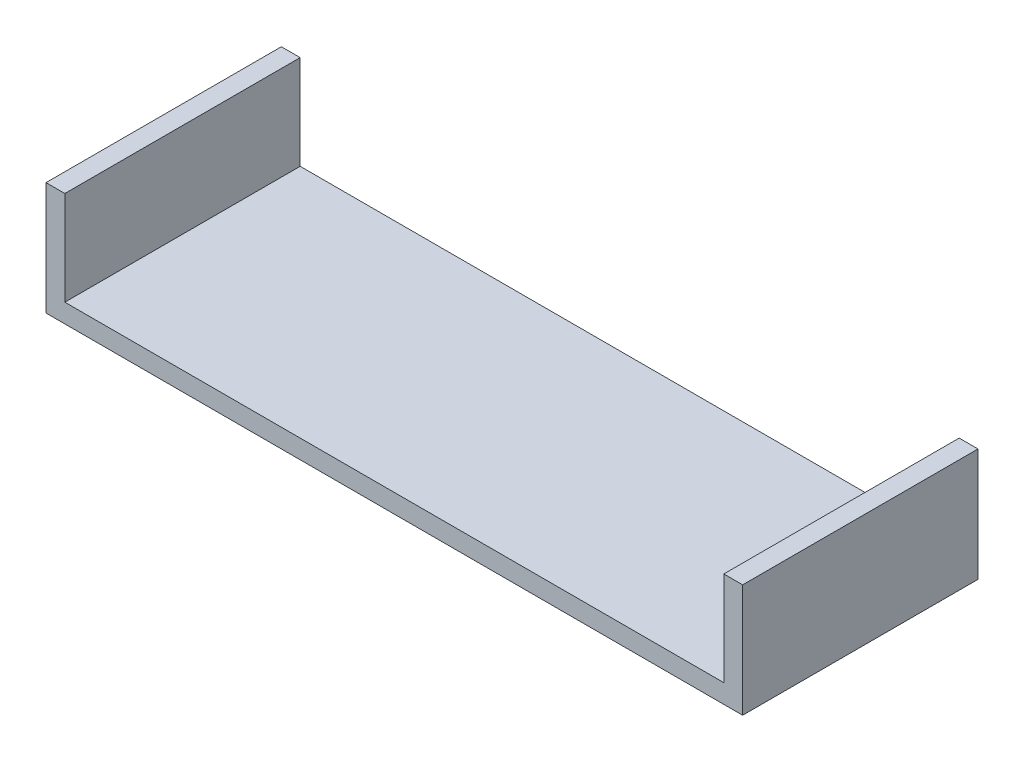
ISO-10303-21;
HEADER;
FILE_DESCRIPTION(('STEP AP214'),'2;1');
FILE_NAME('part.step','',(''),(''),'','','');
FILE_SCHEMA(('AUTOMOTIVE_DESIGN { 1 0 10303 214 1 1 1 1 }'));
ENDSEC;
DATA;
#1=APPLICATION_CONTEXT('core data for automotive mechanical design processes');
#2=APPLICATION_PROTOCOL_DEFINITION('international standard','automotive_design',2000,#1);
#3=PRODUCT_CONTEXT('',#1,'mechanical');
#4=PRODUCT('Part','Part','',(#3));
#5=PRODUCT_RELATED_PRODUCT_CATEGORY('part','',(#4));
#6=PRODUCT_DEFINITION_FORMATION('','',#4);
#7=PRODUCT_DEFINITION_CONTEXT('part definition',#1,'design');
#8=PRODUCT_DEFINITION('design','',#6,#7);
#9=PRODUCT_DEFINITION_SHAPE('','',#8);
#10=(LENGTH_UNIT() NAMED_UNIT(*) SI_UNIT(.MILLI.,.METRE.));
#11=(NAMED_UNIT(*) PLANE_ANGLE_UNIT() SI_UNIT($,.RADIAN.));
#12=(NAMED_UNIT(*) SI_UNIT($,.STERADIAN.) SOLID_ANGLE_UNIT());
#13=UNCERTAINTY_MEASURE_WITH_UNIT(LENGTH_MEASURE(1.E-05),#10,'distance_accuracy_value','');
#14=(GEOMETRIC_REPRESENTATION_CONTEXT(3) GLOBAL_UNCERTAINTY_ASSIGNED_CONTEXT((#13)) GLOBAL_UNIT_ASSIGNED_CONTEXT((#10,
#11,#12)) REPRESENTATION_CONTEXT('',''));
#15=CARTESIAN_POINT('',(0.,0.,0.));
#16=DIRECTION('',(0.,0.,1.));
#17=DIRECTION('',(1.,0.,0.));
#18=AXIS2_PLACEMENT_3D('',#15,#16,#17);
#19=CARTESIAN_POINT('',(-889.,304.8,317.5));
#20=DIRECTION('',(1.,0.,0.));
#21=DIRECTION('',(0.,0.,-1.));
#22=AXIS2_PLACEMENT_3D('',#19,#20,#21);
#23=PLANE('',#22);
#24=DIRECTION('',(0.,-1.,0.));
#25=VECTOR('',#24,1.);
#26=CARTESIAN_POINT('',(-889.,304.8,-317.5));
#27=LINE('',#26,#25);
#28=CARTESIAN_POINT('',(-889.,304.8,-317.5));
#29=VERTEX_POINT('',#28);
#30=CARTESIAN_POINT('',(-889.,50.8,-317.5));
#31=VERTEX_POINT('',#30);
#32=EDGE_CURVE('E142',#29,#31,#27,.T.);
#33=ORIENTED_EDGE('',*,*,#32,.F.);
#34=DIRECTION('',(0.,0.,-1.));
#35=VECTOR('',#34,1.);
#36=CARTESIAN_POINT('',(-889.,304.8,317.5));
#37=LINE('',#36,#35);
#38=CARTESIAN_POINT('',(-889.,304.8,317.5));
#39=VERTEX_POINT('',#38);
#40=EDGE_CURVE('E11',#39,#29,#37,.T.);
#41=ORIENTED_EDGE('',*,*,#40,.F.);
#42=DIRECTION('',(0.,-1.,0.));
#43=VECTOR('',#42,1.);
#44=CARTESIAN_POINT('',(-889.,304.8,317.5));
#45=LINE('',#44,#43);
#46=CARTESIAN_POINT('',(-889.,50.8,317.5));
#47=VERTEX_POINT('',#46);
#48=EDGE_CURVE('E168',#39,#47,#45,.T.);
#49=ORIENTED_EDGE('',*,*,#48,.T.);
#50=DIRECTION('',(0.,0.,-1.));
#51=VECTOR('',#50,1.);
#52=CARTESIAN_POINT('',(-889.,50.8,317.5));
#53=LINE('',#52,#51);
#54=EDGE_CURVE('E46',#47,#31,#53,.T.);
#55=ORIENTED_EDGE('',*,*,#54,.T.);
#56=EDGE_LOOP('',(#33,#41,#49,#55));
#57=FACE_BOUND('',#56,.T.);
#58=ADVANCED_FACE('F43',(#57),#23,.T.);
#59=CARTESIAN_POINT('',(-939.8,304.8,317.5));
#60=DIRECTION('',(0.,1.,0.));
#61=DIRECTION('',(0.,0.,1.));
#62=AXIS2_PLACEMENT_3D('',#59,#60,#61);
#63=PLANE('',#62);
#64=DIRECTION('',(1.,0.,0.));
#65=VECTOR('',#64,1.);
#66=CARTESIAN_POINT('',(-939.8,304.8,-317.5));
#67=LINE('',#66,#65);
#68=CARTESIAN_POINT('',(-939.8,304.8,-317.5));
#69=VERTEX_POINT('',#68);
#70=EDGE_CURVE('E165',#69,#29,#67,.T.);
#71=ORIENTED_EDGE('',*,*,#70,.F.);
#72=DIRECTION('',(0.,0.,-1.));
#73=VECTOR('',#72,1.);
#74=CARTESIAN_POINT('',(-939.8,304.8,317.5));
#75=LINE('',#74,#73);
#76=CARTESIAN_POINT('',(-939.8,304.8,317.5));
#77=VERTEX_POINT('',#76);
#78=EDGE_CURVE('E53',#77,#69,#75,.T.);
#79=ORIENTED_EDGE('',*,*,#78,.F.);
#80=DIRECTION('',(1.,0.,0.));
#81=VECTOR('',#80,1.);
#82=CARTESIAN_POINT('',(-939.8,304.8,317.5));
#83=LINE('',#82,#81);
#84=EDGE_CURVE('E135',#77,#39,#83,.T.);
#85=ORIENTED_EDGE('',*,*,#84,.T.);
#86=ORIENTED_EDGE('',*,*,#40,.T.);
#87=EDGE_LOOP('',(#71,#79,#85,#86));
#88=FACE_BOUND('',#87,.T.);
#89=ADVANCED_FACE('F189',(#88),#63,.T.);
#90=CARTESIAN_POINT('',(-939.8,0.,317.5));
#91=DIRECTION('',(-1.,0.,0.));
#92=DIRECTION('',(0.,0.,1.));
#93=AXIS2_PLACEMENT_3D('',#90,#91,#92);
#94=PLANE('',#93);
#95=DIRECTION('',(0.,1.,0.));
#96=VECTOR('',#95,1.);
#97=CARTESIAN_POINT('',(-939.8,0.,-317.5));
#98=LINE('',#97,#96);
#99=CARTESIAN_POINT('',(-939.8,0.,-317.5));
#100=VERTEX_POINT('',#99);
#101=EDGE_CURVE('E119',#100,#69,#98,.T.);
#102=ORIENTED_EDGE('',*,*,#101,.F.);
#103=DIRECTION('',(0.,0.,-1.));
#104=VECTOR('',#103,1.);
#105=CARTESIAN_POINT('',(-939.8,0.,317.5));
#106=LINE('',#105,#104);
#107=CARTESIAN_POINT('',(-939.8,0.,317.5));
#108=VERTEX_POINT('',#107);
#109=EDGE_CURVE('E113',#108,#100,#106,.T.);
#110=ORIENTED_EDGE('',*,*,#109,.F.);
#111=DIRECTION('',(0.,1.,0.));
#112=VECTOR('',#111,1.);
#113=CARTESIAN_POINT('',(-939.8,0.,317.5));
#114=LINE('',#113,#112);
#115=EDGE_CURVE('E117',#108,#77,#114,.T.);
#116=ORIENTED_EDGE('',*,*,#115,.T.);
#117=ORIENTED_EDGE('',*,*,#78,.T.);
#118=EDGE_LOOP('',(#102,#110,#116,#117));
#119=FACE_BOUND('',#118,.T.);
#120=ADVANCED_FACE('F115',(#119),#94,.T.);
#121=CARTESIAN_POINT('',(-939.8,0.,317.5));
#122=DIRECTION('',(0.,1.,0.));
#123=DIRECTION('',(-1.,0.,0.));
#124=AXIS2_PLACEMENT_3D('',#121,#122,#123);
#125=PLANE('',#124);
#126=DIRECTION('',(1.,0.,0.));
#127=VECTOR('',#126,1.);
#128=CARTESIAN_POINT('',(-939.8,0.,-317.5));
#129=LINE('',#128,#127);
#130=CARTESIAN_POINT('',(939.8,2.30184612367736E-13,-317.5));
#131=VERTEX_POINT('',#130);
#132=EDGE_CURVE('E160',#100,#131,#129,.T.);
#133=ORIENTED_EDGE('',*,*,#132,.T.);
#134=DIRECTION('',(0.,0.,-1.));
#135=VECTOR('',#134,1.);
#136=CARTESIAN_POINT('',(939.8,2.30184612367736E-13,317.5));
#137=LINE('',#136,#135);
#138=CARTESIAN_POINT('',(939.8,2.30184612367736E-13,317.5));
#139=VERTEX_POINT('',#138);
#140=EDGE_CURVE('E123',#139,#131,#137,.T.);
#141=ORIENTED_EDGE('',*,*,#140,.F.);
#142=DIRECTION('',(1.,0.,0.));
#143=VECTOR('',#142,1.);
#144=CARTESIAN_POINT('',(-939.8,0.,317.5));
#145=LINE('',#144,#143);
#146=EDGE_CURVE('E126',#108,#139,#145,.T.);
#147=ORIENTED_EDGE('',*,*,#146,.F.);
#148=ORIENTED_EDGE('',*,*,#109,.T.);
#149=EDGE_LOOP('',(#133,#141,#147,#148));
#150=FACE_BOUND('',#149,.T.);
#151=ADVANCED_FACE('F127',(#150),#125,.F.);
#152=CARTESIAN_POINT('',(939.8,2.30184612367736E-13,317.5));
#153=DIRECTION('',(-1.,0.,0.));
#154=DIRECTION('',(0.,0.,1.));
#155=AXIS2_PLACEMENT_3D('',#152,#153,#154);
#156=PLANE('',#155);
#157=DIRECTION('',(0.,1.,0.));
#158=VECTOR('',#157,1.);
#159=CARTESIAN_POINT('',(939.8,2.30184612367736E-13,-317.5));
#160=LINE('',#159,#158);
#161=CARTESIAN_POINT('',(939.8,304.8,-317.5));
#162=VERTEX_POINT('',#161);
#163=EDGE_CURVE('E157',#131,#162,#160,.T.);
#164=ORIENTED_EDGE('',*,*,#163,.T.);
#165=DIRECTION('',(0.,0.,-1.));
#166=VECTOR('',#165,1.);
#167=CARTESIAN_POINT('',(939.8,304.8,317.5));
#168=LINE('',#167,#166);
#169=CARTESIAN_POINT('',(939.8,304.8,317.5));
#170=VERTEX_POINT('',#169);
#171=EDGE_CURVE('E174',#170,#162,#168,.T.);
#172=ORIENTED_EDGE('',*,*,#171,.F.);
#173=DIRECTION('',(0.,1.,0.));
#174=VECTOR('',#173,1.);
#175=CARTESIAN_POINT('',(939.8,2.30184612367736E-13,317.5));
#176=LINE('',#175,#174);
#177=EDGE_CURVE('E132',#139,#170,#176,.T.);
#178=ORIENTED_EDGE('',*,*,#177,.F.);
#179=ORIENTED_EDGE('',*,*,#140,.T.);
#180=EDGE_LOOP('',(#164,#172,#178,#179));
#181=FACE_BOUND('',#180,.T.);
#182=ADVANCED_FACE('F202',(#181),#156,.F.);
#183=CARTESIAN_POINT('',(939.8,304.8,317.5));
#184=DIRECTION('',(0.,-1.,0.));
#185=DIRECTION('',(0.,0.,-1.));
#186=AXIS2_PLACEMENT_3D('',#183,#184,#185);
#187=PLANE('',#186);
#188=DIRECTION('',(-1.,0.,0.));
#189=VECTOR('',#188,1.);
#190=CARTESIAN_POINT('',(939.8,304.8,-317.5));
#191=LINE('',#190,#189);
#192=CARTESIAN_POINT('',(889.,304.8,-317.5));
#193=VERTEX_POINT('',#192);
#194=EDGE_CURVE('E154',#162,#193,#191,.T.);
#195=ORIENTED_EDGE('',*,*,#194,.T.);
#196=DIRECTION('',(0.,0.,-1.));
#197=VECTOR('',#196,1.);
#198=CARTESIAN_POINT('',(889.,304.8,317.5));
#199=LINE('',#198,#197);
#200=CARTESIAN_POINT('',(889.,304.8,317.5));
#201=VERTEX_POINT('',#200);
#202=EDGE_CURVE('E178',#201,#193,#199,.T.);
#203=ORIENTED_EDGE('',*,*,#202,.F.);
#204=DIRECTION('',(-1.,0.,0.));
#205=VECTOR('',#204,1.);
#206=CARTESIAN_POINT('',(939.8,304.8,317.5));
#207=LINE('',#206,#205);
#208=EDGE_CURVE('E300',#170,#201,#207,.T.);
#209=ORIENTED_EDGE('',*,*,#208,.F.);
#210=ORIENTED_EDGE('',*,*,#171,.T.);
#211=EDGE_LOOP('',(#195,#203,#209,#210));
#212=FACE_BOUND('',#211,.T.);
#213=ADVANCED_FACE('F205',(#212),#187,.F.);
#214=CARTESIAN_POINT('',(889.,304.8,317.5));
#215=DIRECTION('',(1.,0.,0.));
#216=DIRECTION('',(0.,0.,-1.));
#217=AXIS2_PLACEMENT_3D('',#214,#215,#216);
#218=PLANE('',#217);
#219=DIRECTION('',(0.,-1.,0.));
#220=VECTOR('',#219,1.);
#221=CARTESIAN_POINT('',(889.,304.8,-317.5));
#222=LINE('',#221,#220);
#223=CARTESIAN_POINT('',(889.,50.8000000000002,-317.5));
#224=VERTEX_POINT('',#223);
#225=EDGE_CURVE('E150',#193,#224,#222,.T.);
#226=ORIENTED_EDGE('',*,*,#225,.T.);
#227=DIRECTION('',(0.,0.,-1.));
#228=VECTOR('',#227,1.);
#229=CARTESIAN_POINT('',(889.,50.8000000000002,317.5));
#230=LINE('',#229,#228);
#231=CARTESIAN_POINT('',(889.,50.8000000000002,317.5));
#232=VERTEX_POINT('',#231);
#233=EDGE_CURVE('E181',#232,#224,#230,.T.);
#234=ORIENTED_EDGE('',*,*,#233,.F.);
#235=DIRECTION('',(0.,-1.,0.));
#236=VECTOR('',#235,1.);
#237=CARTESIAN_POINT('',(889.,304.8,317.5));
#238=LINE('',#237,#236);
#239=EDGE_CURVE('E303',#201,#232,#238,.T.);
#240=ORIENTED_EDGE('',*,*,#239,.F.);
#241=ORIENTED_EDGE('',*,*,#202,.T.);
#242=EDGE_LOOP('',(#226,#234,#240,#241));
#243=FACE_BOUND('',#242,.T.);
#244=ADVANCED_FACE('F209',(#243),#218,.F.);
#245=CARTESIAN_POINT('',(-889.,50.8,317.5));
#246=DIRECTION('',(0.,1.,0.));
#247=DIRECTION('',(-1.,0.,0.));
#248=AXIS2_PLACEMENT_3D('',#245,#246,#247);
#249=PLANE('',#248);
#250=DIRECTION('',(1.,0.,0.));
#251=VECTOR('',#250,1.);
#252=CARTESIAN_POINT('',(-889.,50.8,-317.5));
#253=LINE('',#252,#251);
#254=EDGE_CURVE('E146',#31,#224,#253,.T.);
#255=ORIENTED_EDGE('',*,*,#254,.F.);
#256=ORIENTED_EDGE('',*,*,#54,.F.);
#257=DIRECTION('',(1.,0.,0.));
#258=VECTOR('',#257,1.);
#259=CARTESIAN_POINT('',(-889.,50.8,317.5));
#260=LINE('',#259,#258);
#261=EDGE_CURVE('E308',#47,#232,#260,.T.);
#262=ORIENTED_EDGE('',*,*,#261,.T.);
#263=ORIENTED_EDGE('',*,*,#233,.T.);
#264=EDGE_LOOP('',(#255,#256,#262,#263));
#265=FACE_BOUND('',#264,.T.);
#266=ADVANCED_FACE('F185',(#265),#249,.T.);
#267=CARTESIAN_POINT('',(0.,0.,317.5));
#268=DIRECTION('',(0.,0.,1.));
#269=DIRECTION('',(1.,0.,0.));
#270=AXIS2_PLACEMENT_3D('',#267,#268,#269);
#271=PLANE('',#270);
#272=ORIENTED_EDGE('',*,*,#48,.F.);
#273=ORIENTED_EDGE('',*,*,#84,.F.);
#274=ORIENTED_EDGE('',*,*,#115,.F.);
#275=ORIENTED_EDGE('',*,*,#146,.T.);
#276=ORIENTED_EDGE('',*,*,#177,.T.);
#277=ORIENTED_EDGE('',*,*,#208,.T.);
#278=ORIENTED_EDGE('',*,*,#239,.T.);
#279=ORIENTED_EDGE('',*,*,#261,.F.);
#280=EDGE_LOOP('',(#272,#273,#274,#275,#276,#277,#278,#279));
#281=FACE_BOUND('',#280,.T.);
#282=ADVANCED_FACE('F134',(#281),#271,.T.);
#283=CARTESIAN_POINT('',(0.,0.,-317.5));
#284=DIRECTION('',(0.,0.,1.));
#285=DIRECTION('',(1.,0.,0.));
#286=AXIS2_PLACEMENT_3D('',#283,#284,#285);
#287=PLANE('',#286);
#288=ORIENTED_EDGE('',*,*,#32,.T.);
#289=ORIENTED_EDGE('',*,*,#254,.T.);
#290=ORIENTED_EDGE('',*,*,#225,.F.);
#291=ORIENTED_EDGE('',*,*,#194,.F.);
#292=ORIENTED_EDGE('',*,*,#163,.F.);
#293=ORIENTED_EDGE('',*,*,#132,.F.);
#294=ORIENTED_EDGE('',*,*,#101,.T.);
#295=ORIENTED_EDGE('',*,*,#70,.T.);
#296=EDGE_LOOP('',(#288,#289,#290,#291,#292,#293,#294,#295));
#297=FACE_BOUND('',#296,.T.);
#298=ADVANCED_FACE('F188',(#297),#287,.F.);
#299=CLOSED_SHELL('',(#58,#89,#120,#151,#182,#213,#244,#266,#282,#298));
#300=MANIFOLD_SOLID_BREP('B2',#299);
#301=ADVANCED_BREP_SHAPE_REPRESENTATION('',(#18,#300),#14);
#302=SHAPE_DEFINITION_REPRESENTATION(#9,#301);
ENDSEC;
END-ISO-10303-21;
